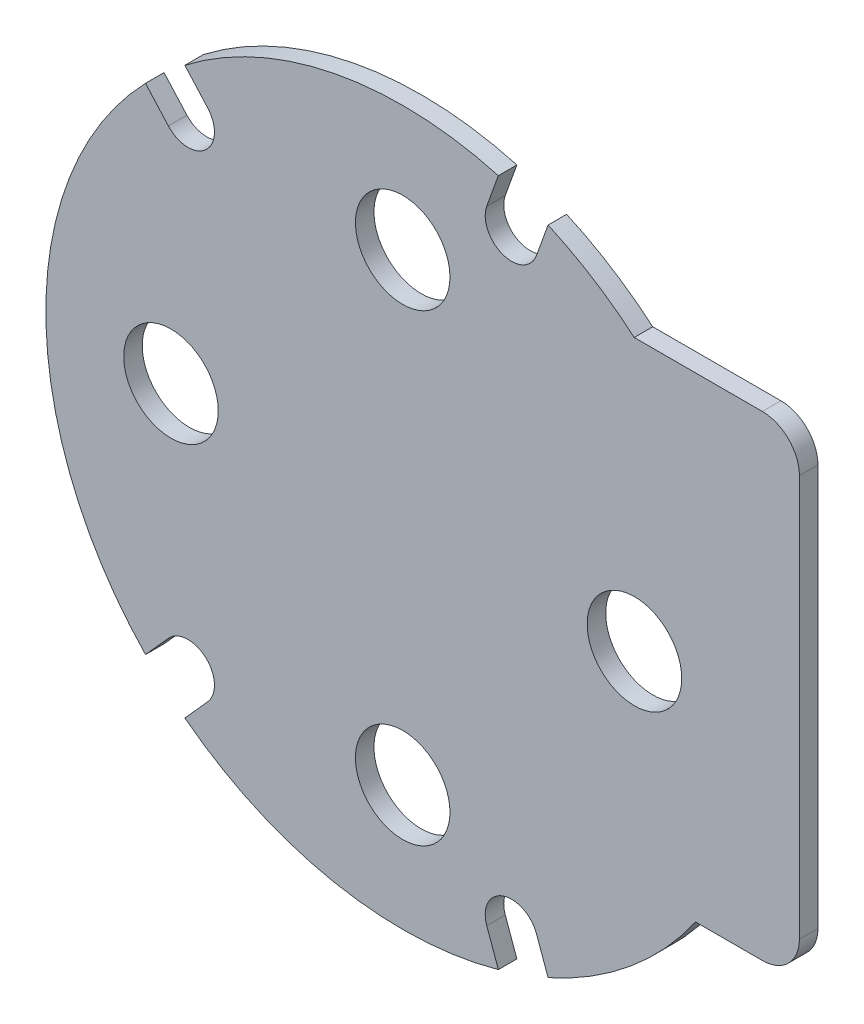
ISO-10303-21;
HEADER;
FILE_DESCRIPTION(('STEP AP214'),'2;1');
FILE_NAME('part.step','',(''),(''),'','','');
FILE_SCHEMA(('AUTOMOTIVE_DESIGN { 1 0 10303 214 1 1 1 1 }'));
ENDSEC;
DATA;
#1=APPLICATION_CONTEXT('core data for automotive mechanical design processes');
#2=APPLICATION_PROTOCOL_DEFINITION('international standard','automotive_design',2000,#1);
#3=PRODUCT_CONTEXT('',#1,'mechanical');
#4=PRODUCT('Part','Part','',(#3));
#5=PRODUCT_RELATED_PRODUCT_CATEGORY('part','',(#4));
#6=PRODUCT_DEFINITION_FORMATION('','',#4);
#7=PRODUCT_DEFINITION_CONTEXT('part definition',#1,'design');
#8=PRODUCT_DEFINITION('design','',#6,#7);
#9=PRODUCT_DEFINITION_SHAPE('','',#8);
#10=(LENGTH_UNIT() NAMED_UNIT(*) SI_UNIT(.MILLI.,.METRE.));
#11=(NAMED_UNIT(*) PLANE_ANGLE_UNIT() SI_UNIT($,.RADIAN.));
#12=(NAMED_UNIT(*) SI_UNIT($,.STERADIAN.) SOLID_ANGLE_UNIT());
#13=UNCERTAINTY_MEASURE_WITH_UNIT(LENGTH_MEASURE(1.E-05),#10,'distance_accuracy_value','');
#14=(GEOMETRIC_REPRESENTATION_CONTEXT(3) GLOBAL_UNCERTAINTY_ASSIGNED_CONTEXT((#13)) GLOBAL_UNIT_ASSIGNED_CONTEXT((#10,
#11,#12)) REPRESENTATION_CONTEXT('',''));
#15=CARTESIAN_POINT('',(0.,0.,0.));
#16=DIRECTION('',(0.,0.,1.));
#17=DIRECTION('',(1.,0.,0.));
#18=AXIS2_PLACEMENT_3D('',#15,#16,#17);
#19=CARTESIAN_POINT('',(0.,0.,2.));
#20=DIRECTION('',(0.,0.,1.));
#21=DIRECTION('',(1.,0.,0.));
#22=AXIS2_PLACEMENT_3D('',#19,#20,#21);
#23=PLANE('',#22);
#24=CARTESIAN_POINT('',(0.,25.,2.));
#25=DIRECTION('',(0.,0.,1.));
#26=DIRECTION('',(1.,0.,0.));
#27=AXIS2_PLACEMENT_3D('',#24,#25,#26);
#28=CIRCLE('',#27,5.1);
#29=CARTESIAN_POINT('',(5.09999999999999,25.,2.));
#30=VERTEX_POINT('',#29);
#31=EDGE_CURVE('E309',#30,#30,#28,.T.);
#32=ORIENTED_EDGE('',*,*,#31,.F.);
#33=EDGE_LOOP('',(#32));
#34=FACE_BOUND('',#33,.T.);
#35=CARTESIAN_POINT('',(0.,-25.,2.));
#36=DIRECTION('',(0.,0.,1.));
#37=DIRECTION('',(1.,0.,0.));
#38=AXIS2_PLACEMENT_3D('',#35,#36,#37);
#39=CIRCLE('',#38,5.1);
#40=CARTESIAN_POINT('',(5.10000000000001,-25.,2.));
#41=VERTEX_POINT('',#40);
#42=EDGE_CURVE('E321',#41,#41,#39,.T.);
#43=ORIENTED_EDGE('',*,*,#42,.F.);
#44=EDGE_LOOP('',(#43));
#45=FACE_BOUND('',#44,.T.);
#46=CARTESIAN_POINT('',(-25.,0.,2.));
#47=DIRECTION('',(0.,0.,1.));
#48=DIRECTION('',(1.,0.,0.));
#49=AXIS2_PLACEMENT_3D('',#46,#47,#48);
#50=CIRCLE('',#49,5.1);
#51=CARTESIAN_POINT('',(-19.9,0.,2.));
#52=VERTEX_POINT('',#51);
#53=EDGE_CURVE('E315',#52,#52,#50,.T.);
#54=ORIENTED_EDGE('',*,*,#53,.F.);
#55=EDGE_LOOP('',(#54));
#56=FACE_BOUND('',#55,.T.);
#57=CARTESIAN_POINT('',(25.,0.,2.));
#58=DIRECTION('',(0.,0.,1.));
#59=DIRECTION('',(1.,0.,0.));
#60=AXIS2_PLACEMENT_3D('',#57,#58,#59);
#61=CIRCLE('',#60,5.1);
#62=CARTESIAN_POINT('',(30.1,0.,2.));
#63=VERTEX_POINT('',#62);
#64=EDGE_CURVE('E303',#63,#63,#61,.T.);
#65=ORIENTED_EDGE('',*,*,#64,.F.);
#66=EDGE_LOOP('',(#65));
#67=FACE_BOUND('',#66,.T.);
#68=DIRECTION('',(0.,1.,0.));
#69=VECTOR('',#68,1.);
#70=CARTESIAN_POINT('',(42.8,29.3,2.));
#71=LINE('',#70,#69);
#72=CARTESIAN_POINT('',(42.8,-18.,2.));
#73=VERTEX_POINT('',#72);
#74=CARTESIAN_POINT('',(42.8,25.3,2.));
#75=VERTEX_POINT('',#74);
#76=EDGE_CURVE('E332',#73,#75,#71,.T.);
#77=ORIENTED_EDGE('',*,*,#76,.T.);
#78=CARTESIAN_POINT('',(38.8,25.3,2.));
#79=DIRECTION('',(0.,0.,1.));
#80=DIRECTION('',(1.,0.,0.));
#81=AXIS2_PLACEMENT_3D('',#78,#79,#80);
#82=CIRCLE('',#81,4.);
#83=CARTESIAN_POINT('',(38.8,29.3,2.));
#84=VERTEX_POINT('',#83);
#85=EDGE_CURVE('E40',#75,#84,#82,.T.);
#86=ORIENTED_EDGE('',*,*,#85,.T.);
#87=DIRECTION('',(-1.,0.,0.));
#88=VECTOR('',#87,1.);
#89=CARTESIAN_POINT('',(24.9751876869825,29.3,2.));
#90=LINE('',#89,#88);
#91=CARTESIAN_POINT('',(24.9751876869825,29.3,2.));
#92=VERTEX_POINT('',#91);
#93=EDGE_CURVE('E334',#84,#92,#90,.T.);
#94=ORIENTED_EDGE('',*,*,#93,.T.);
#95=CARTESIAN_POINT('',(0.,0.,2.));
#96=DIRECTION('',(0.,0.,1.));
#97=DIRECTION('',(1.,0.,0.));
#98=AXIS2_PLACEMENT_3D('',#95,#96,#97);
#99=CIRCLE('',#98,38.5);
#100=CARTESIAN_POINT('',(15.6828384392033,35.161037790285,2.));
#101=VERTEX_POINT('',#100);
#102=EDGE_CURVE('E207',#92,#101,#99,.T.);
#103=ORIENTED_EDGE('',*,*,#102,.T.);
#104=DIRECTION('',(0.338622846225681,0.940922190201729,0.));
#105=VECTOR('',#104,1.);
#106=CARTESIAN_POINT('',(14.4318410061061,31.6849248882568,2.));
#107=LINE('',#106,#105);
#108=CARTESIAN_POINT('',(14.4318410061061,31.6849248882568,2.));
#109=VERTEX_POINT('',#108);
#110=EDGE_CURVE('E194',#109,#101,#107,.T.);
#111=ORIENTED_EDGE('',*,*,#110,.F.);
#112=CARTESIAN_POINT('',(11.7502127640311,32.65,2.));
#113=DIRECTION('',(0.,0.,1.));
#114=DIRECTION('',(1.,0.,0.));
#115=AXIS2_PLACEMENT_3D('',#112,#113,#114);
#116=CIRCLE('',#115,2.85);
#117=CARTESIAN_POINT('',(9.06858452195621,33.6150751117432,2.));
#118=VERTEX_POINT('',#117);
#119=EDGE_CURVE('E184',#118,#109,#116,.T.);
#120=ORIENTED_EDGE('',*,*,#119,.F.);
#121=DIRECTION('',(-0.338622846225681,-0.940922190201729,0.));
#122=VECTOR('',#121,1.);
#123=CARTESIAN_POINT('',(9.06858452195621,33.6150751117432,2.));
#124=LINE('',#123,#122);
#125=CARTESIAN_POINT('',(10.3195819550534,37.0911880137714,2.));
#126=VERTEX_POINT('',#125);
#127=EDGE_CURVE('E208',#126,#118,#124,.T.);
#128=ORIENTED_EDGE('',*,*,#127,.F.);
#129=CARTESIAN_POINT('',(-23.5034170023146,30.493267932698,2.));
#130=VERTEX_POINT('',#129);
#131=EDGE_CURVE('E329',#126,#130,#99,.T.);
#132=ORIENTED_EDGE('',*,*,#131,.T.);
#133=DIRECTION('',(-0.667434411909216,0.744668587896253,0.));
#134=VECTOR('',#133,1.);
#135=CARTESIAN_POINT('',(-21.0376686177454,27.7421880739413,2.));
#136=LINE('',#135,#134);
#137=CARTESIAN_POINT('',(-21.0376686177454,27.7421880739413,2.));
#138=VERTEX_POINT('',#137);
#139=EDGE_CURVE('E224',#138,#130,#136,.T.);
#140=ORIENTED_EDGE('',*,*,#139,.F.);
#141=CARTESIAN_POINT('',(-23.1599740932498,25.84,2.));
#142=DIRECTION('',(0.,0.,1.));
#143=DIRECTION('',(1.,0.,0.));
#144=AXIS2_PLACEMENT_3D('',#141,#142,#143);
#145=CIRCLE('',#144,2.85);
#146=CARTESIAN_POINT('',(-25.2822795687541,23.9378119260587,2.));
#147=VERTEX_POINT('',#146);
#148=EDGE_CURVE('E222',#147,#138,#145,.T.);
#149=ORIENTED_EDGE('',*,*,#148,.F.);
#150=DIRECTION('',(0.667434411909216,-0.744668587896253,0.));
#151=VECTOR('',#150,1.);
#152=CARTESIAN_POINT('',(-25.2822795687541,23.9378119260587,2.));
#153=LINE('',#152,#151);
#154=CARTESIAN_POINT('',(-27.7480279533233,26.6888917848155,2.));
#155=VERTEX_POINT('',#154);
#156=EDGE_CURVE('E228',#155,#147,#153,.T.);
#157=ORIENTED_EDGE('',*,*,#156,.F.);
#158=CARTESIAN_POINT('',(-27.7480279533233,-26.6888917848155,2.));
#159=VERTEX_POINT('',#158);
#160=EDGE_CURVE('E411',#155,#159,#99,.T.);
#161=ORIENTED_EDGE('',*,*,#160,.T.);
#162=DIRECTION('',(-0.667434411909216,-0.744668587896253,0.));
#163=VECTOR('',#162,1.);
#164=CARTESIAN_POINT('',(-25.2822795687541,-23.9378119260587,2.));
#165=LINE('',#164,#163);
#166=CARTESIAN_POINT('',(-25.2822795687541,-23.9378119260587,2.));
#167=VERTEX_POINT('',#166);
#168=EDGE_CURVE('E251',#167,#159,#165,.T.);
#169=ORIENTED_EDGE('',*,*,#168,.F.);
#170=CARTESIAN_POINT('',(-23.1599740932498,-25.84,2.));
#171=DIRECTION('',(0.,0.,1.));
#172=DIRECTION('',(-1.,0.,0.));
#173=AXIS2_PLACEMENT_3D('',#170,#171,#172);
#174=CIRCLE('',#173,2.85);
#175=CARTESIAN_POINT('',(-21.0376686177454,-27.7421880739413,2.));
#176=VERTEX_POINT('',#175);
#177=EDGE_CURVE('E249',#176,#167,#174,.T.);
#178=ORIENTED_EDGE('',*,*,#177,.F.);
#179=DIRECTION('',(0.667434411909216,0.744668587896253,0.));
#180=VECTOR('',#179,1.);
#181=CARTESIAN_POINT('',(-21.0376686177454,-27.7421880739413,2.));
#182=LINE('',#181,#180);
#183=CARTESIAN_POINT('',(-23.5034170023146,-30.493267932698,2.));
#184=VERTEX_POINT('',#183);
#185=EDGE_CURVE('E255',#184,#176,#182,.T.);
#186=ORIENTED_EDGE('',*,*,#185,.F.);
#187=CARTESIAN_POINT('',(10.3195819550534,-37.0911880137714,2.));
#188=VERTEX_POINT('',#187);
#189=EDGE_CURVE('E412',#184,#188,#99,.T.);
#190=ORIENTED_EDGE('',*,*,#189,.T.);
#191=DIRECTION('',(0.338622846225681,-0.940922190201729,0.));
#192=VECTOR('',#191,1.);
#193=CARTESIAN_POINT('',(9.06858452195621,-33.6150751117432,2.));
#194=LINE('',#193,#192);
#195=CARTESIAN_POINT('',(9.06858452195621,-33.6150751117432,2.));
#196=VERTEX_POINT('',#195);
#197=EDGE_CURVE('E278',#196,#188,#194,.T.);
#198=ORIENTED_EDGE('',*,*,#197,.F.);
#199=CARTESIAN_POINT('',(11.7502127640311,-32.65,2.));
#200=DIRECTION('',(0.,0.,1.));
#201=DIRECTION('',(-1.,0.,0.));
#202=AXIS2_PLACEMENT_3D('',#199,#200,#201);
#203=CIRCLE('',#202,2.85);
#204=CARTESIAN_POINT('',(14.4318410061061,-31.6849248882568,2.));
#205=VERTEX_POINT('',#204);
#206=EDGE_CURVE('E276',#205,#196,#203,.T.);
#207=ORIENTED_EDGE('',*,*,#206,.F.);
#208=DIRECTION('',(-0.338622846225681,0.940922190201729,0.));
#209=VECTOR('',#208,1.);
#210=CARTESIAN_POINT('',(14.4318410061061,-31.6849248882568,2.));
#211=LINE('',#210,#209);
#212=CARTESIAN_POINT('',(15.6828384392033,-35.161037790285,2.));
#213=VERTEX_POINT('',#212);
#214=EDGE_CURVE('E282',#213,#205,#211,.T.);
#215=ORIENTED_EDGE('',*,*,#214,.F.);
#216=CARTESIAN_POINT('',(31.5950945559592,-22.,2.));
#217=VERTEX_POINT('',#216);
#218=EDGE_CURVE('E330',#213,#217,#99,.T.);
#219=ORIENTED_EDGE('',*,*,#218,.T.);
#220=DIRECTION('',(1.,0.,0.));
#221=VECTOR('',#220,1.);
#222=CARTESIAN_POINT('',(42.8,-22.,2.));
#223=LINE('',#222,#221);
#224=CARTESIAN_POINT('',(38.8,-22.,2.));
#225=VERTEX_POINT('',#224);
#226=EDGE_CURVE('E328',#217,#225,#223,.T.);
#227=ORIENTED_EDGE('',*,*,#226,.T.);
#228=CARTESIAN_POINT('',(38.8,-18.,2.));
#229=DIRECTION('',(0.,0.,1.));
#230=DIRECTION('',(1.,0.,0.));
#231=AXIS2_PLACEMENT_3D('',#228,#229,#230);
#232=CIRCLE('',#231,4.);
#233=EDGE_CURVE('E363',#225,#73,#232,.T.);
#234=ORIENTED_EDGE('',*,*,#233,.T.);
#235=EDGE_LOOP('',(#77,#86,#94,#103,#111,#120,#128,#132,#140,#149,#157,#161,#169,#178,#186,#190,
#198,#207,#215,#219,#227,#234));
#236=FACE_BOUND('',#235,.T.);
#237=ADVANCED_FACE('F32',(#34,#45,#56,#67,#236),#23,.T.);
#238=CARTESIAN_POINT('',(0.,0.,0.));
#239=DIRECTION('',(0.,0.,1.));
#240=DIRECTION('',(1.,0.,0.));
#241=AXIS2_PLACEMENT_3D('',#238,#239,#240);
#242=PLANE('',#241);
#243=CARTESIAN_POINT('',(0.,25.,0.));
#244=DIRECTION('',(0.,0.,1.));
#245=DIRECTION('',(1.,0.,0.));
#246=AXIS2_PLACEMENT_3D('',#243,#244,#245);
#247=CIRCLE('',#246,5.1);
#248=CARTESIAN_POINT('',(5.09999999999999,25.,0.));
#249=VERTEX_POINT('',#248);
#250=EDGE_CURVE('E306',#249,#249,#247,.T.);
#251=ORIENTED_EDGE('',*,*,#250,.T.);
#252=EDGE_LOOP('',(#251));
#253=FACE_BOUND('',#252,.T.);
#254=CARTESIAN_POINT('',(0.,-25.,0.));
#255=DIRECTION('',(0.,0.,1.));
#256=DIRECTION('',(1.,0.,0.));
#257=AXIS2_PLACEMENT_3D('',#254,#255,#256);
#258=CIRCLE('',#257,5.1);
#259=CARTESIAN_POINT('',(5.10000000000001,-25.,0.));
#260=VERTEX_POINT('',#259);
#261=EDGE_CURVE('E318',#260,#260,#258,.T.);
#262=ORIENTED_EDGE('',*,*,#261,.T.);
#263=EDGE_LOOP('',(#262));
#264=FACE_BOUND('',#263,.T.);
#265=CARTESIAN_POINT('',(-25.,0.,0.));
#266=DIRECTION('',(0.,0.,1.));
#267=DIRECTION('',(1.,0.,0.));
#268=AXIS2_PLACEMENT_3D('',#265,#266,#267);
#269=CIRCLE('',#268,5.1);
#270=CARTESIAN_POINT('',(-19.9,0.,0.));
#271=VERTEX_POINT('',#270);
#272=EDGE_CURVE('E312',#271,#271,#269,.T.);
#273=ORIENTED_EDGE('',*,*,#272,.T.);
#274=EDGE_LOOP('',(#273));
#275=FACE_BOUND('',#274,.T.);
#276=CARTESIAN_POINT('',(25.,0.,0.));
#277=DIRECTION('',(0.,0.,1.));
#278=DIRECTION('',(1.,0.,0.));
#279=AXIS2_PLACEMENT_3D('',#276,#277,#278);
#280=CIRCLE('',#279,5.1);
#281=CARTESIAN_POINT('',(30.1,0.,0.));
#282=VERTEX_POINT('',#281);
#283=EDGE_CURVE('E302',#282,#282,#280,.T.);
#284=ORIENTED_EDGE('',*,*,#283,.T.);
#285=EDGE_LOOP('',(#284));
#286=FACE_BOUND('',#285,.T.);
#287=DIRECTION('',(-1.,0.,0.));
#288=VECTOR('',#287,1.);
#289=CARTESIAN_POINT('',(24.9751876869825,29.3,0.));
#290=LINE('',#289,#288);
#291=CARTESIAN_POINT('',(38.8,29.3,0.));
#292=VERTEX_POINT('',#291);
#293=CARTESIAN_POINT('',(24.9751876869825,29.3,0.));
#294=VERTEX_POINT('',#293);
#295=EDGE_CURVE('E345',#292,#294,#290,.T.);
#296=ORIENTED_EDGE('',*,*,#295,.F.);
#297=CARTESIAN_POINT('',(38.8,25.3,0.));
#298=DIRECTION('',(0.,0.,1.));
#299=DIRECTION('',(1.,0.,0.));
#300=AXIS2_PLACEMENT_3D('',#297,#298,#299);
#301=CIRCLE('',#300,4.);
#302=CARTESIAN_POINT('',(42.8,25.3,0.));
#303=VERTEX_POINT('',#302);
#304=EDGE_CURVE('E357',#292,#303,#301,.F.);
#305=ORIENTED_EDGE('',*,*,#304,.T.);
#306=DIRECTION('',(0.,1.,0.));
#307=VECTOR('',#306,1.);
#308=CARTESIAN_POINT('',(42.8,29.3,0.));
#309=LINE('',#308,#307);
#310=CARTESIAN_POINT('',(42.8,-18.,0.));
#311=VERTEX_POINT('',#310);
#312=EDGE_CURVE('E343',#311,#303,#309,.T.);
#313=ORIENTED_EDGE('',*,*,#312,.F.);
#314=CARTESIAN_POINT('',(38.8,-18.,0.));
#315=DIRECTION('',(0.,0.,1.));
#316=DIRECTION('',(1.,0.,0.));
#317=AXIS2_PLACEMENT_3D('',#314,#315,#316);
#318=CIRCLE('',#317,4.);
#319=CARTESIAN_POINT('',(38.8,-22.,0.));
#320=VERTEX_POINT('',#319);
#321=EDGE_CURVE('E355',#311,#320,#318,.F.);
#322=ORIENTED_EDGE('',*,*,#321,.T.);
#323=DIRECTION('',(1.,0.,0.));
#324=VECTOR('',#323,1.);
#325=CARTESIAN_POINT('',(42.8,-22.,0.));
#326=LINE('',#325,#324);
#327=CARTESIAN_POINT('',(31.5950945559592,-22.,0.));
#328=VERTEX_POINT('',#327);
#329=EDGE_CURVE('E340',#328,#320,#326,.T.);
#330=ORIENTED_EDGE('',*,*,#329,.F.);
#331=CARTESIAN_POINT('',(0.,0.,0.));
#332=DIRECTION('',(0.,0.,1.));
#333=DIRECTION('',(1.,0.,0.));
#334=AXIS2_PLACEMENT_3D('',#331,#332,#333);
#335=CIRCLE('',#334,38.5);
#336=CARTESIAN_POINT('',(15.6828384392033,-35.161037790285,0.));
#337=VERTEX_POINT('',#336);
#338=EDGE_CURVE('E324',#337,#328,#335,.T.);
#339=ORIENTED_EDGE('',*,*,#338,.F.);
#340=DIRECTION('',(-0.338622846225681,0.940922190201729,0.));
#341=VECTOR('',#340,1.);
#342=CARTESIAN_POINT('',(14.4318410061061,-31.6849248882568,0.));
#343=LINE('',#342,#341);
#344=CARTESIAN_POINT('',(14.4318410061061,-31.6849248882568,0.));
#345=VERTEX_POINT('',#344);
#346=EDGE_CURVE('E279',#337,#345,#343,.T.);
#347=ORIENTED_EDGE('',*,*,#346,.T.);
#348=CARTESIAN_POINT('',(11.7502127640311,-32.65,0.));
#349=DIRECTION('',(0.,0.,1.));
#350=DIRECTION('',(-1.,0.,0.));
#351=AXIS2_PLACEMENT_3D('',#348,#349,#350);
#352=CIRCLE('',#351,2.85);
#353=CARTESIAN_POINT('',(9.06858452195621,-33.6150751117432,0.));
#354=VERTEX_POINT('',#353);
#355=EDGE_CURVE('E275',#345,#354,#352,.T.);
#356=ORIENTED_EDGE('',*,*,#355,.T.);
#357=DIRECTION('',(0.338622846225681,-0.940922190201729,0.));
#358=VECTOR('',#357,1.);
#359=CARTESIAN_POINT('',(9.06858452195621,-33.6150751117432,0.));
#360=LINE('',#359,#358);
#361=CARTESIAN_POINT('',(10.3195819550534,-37.0911880137714,0.));
#362=VERTEX_POINT('',#361);
#363=EDGE_CURVE('E287',#354,#362,#360,.T.);
#364=ORIENTED_EDGE('',*,*,#363,.T.);
#365=CARTESIAN_POINT('',(-23.5034170023146,-30.493267932698,0.));
#366=VERTEX_POINT('',#365);
#367=EDGE_CURVE('E388',#366,#362,#335,.T.);
#368=ORIENTED_EDGE('',*,*,#367,.F.);
#369=DIRECTION('',(0.667434411909216,0.744668587896253,0.));
#370=VECTOR('',#369,1.);
#371=CARTESIAN_POINT('',(-21.0376686177454,-27.7421880739413,0.));
#372=LINE('',#371,#370);
#373=CARTESIAN_POINT('',(-21.0376686177454,-27.7421880739413,0.));
#374=VERTEX_POINT('',#373);
#375=EDGE_CURVE('E252',#366,#374,#372,.T.);
#376=ORIENTED_EDGE('',*,*,#375,.T.);
#377=CARTESIAN_POINT('',(-23.1599740932498,-25.84,0.));
#378=DIRECTION('',(0.,0.,1.));
#379=DIRECTION('',(-1.,0.,0.));
#380=AXIS2_PLACEMENT_3D('',#377,#378,#379);
#381=CIRCLE('',#380,2.85);
#382=CARTESIAN_POINT('',(-25.2822795687541,-23.9378119260587,0.));
#383=VERTEX_POINT('',#382);
#384=EDGE_CURVE('E248',#374,#383,#381,.T.);
#385=ORIENTED_EDGE('',*,*,#384,.T.);
#386=DIRECTION('',(-0.667434411909216,-0.744668587896253,0.));
#387=VECTOR('',#386,1.);
#388=CARTESIAN_POINT('',(-25.2822795687541,-23.9378119260587,0.));
#389=LINE('',#388,#387);
#390=CARTESIAN_POINT('',(-27.7480279533233,-26.6888917848155,0.));
#391=VERTEX_POINT('',#390);
#392=EDGE_CURVE('E260',#383,#391,#389,.T.);
#393=ORIENTED_EDGE('',*,*,#392,.T.);
#394=CARTESIAN_POINT('',(-27.7480279533233,26.6888917848155,0.));
#395=VERTEX_POINT('',#394);
#396=EDGE_CURVE('E389',#395,#391,#335,.T.);
#397=ORIENTED_EDGE('',*,*,#396,.F.);
#398=DIRECTION('',(0.667434411909216,-0.744668587896253,0.));
#399=VECTOR('',#398,1.);
#400=CARTESIAN_POINT('',(-25.2822795687541,23.9378119260587,0.));
#401=LINE('',#400,#399);
#402=CARTESIAN_POINT('',(-25.2822795687541,23.9378119260587,0.));
#403=VERTEX_POINT('',#402);
#404=EDGE_CURVE('E225',#395,#403,#401,.T.);
#405=ORIENTED_EDGE('',*,*,#404,.T.);
#406=CARTESIAN_POINT('',(-23.1599740932498,25.84,0.));
#407=DIRECTION('',(0.,0.,1.));
#408=DIRECTION('',(1.,0.,0.));
#409=AXIS2_PLACEMENT_3D('',#406,#407,#408);
#410=CIRCLE('',#409,2.85);
#411=CARTESIAN_POINT('',(-21.0376686177454,27.7421880739413,0.));
#412=VERTEX_POINT('',#411);
#413=EDGE_CURVE('E202',#403,#412,#410,.T.);
#414=ORIENTED_EDGE('',*,*,#413,.T.);
#415=DIRECTION('',(-0.667434411909216,0.744668587896253,0.));
#416=VECTOR('',#415,1.);
#417=CARTESIAN_POINT('',(-21.0376686177454,27.7421880739413,0.));
#418=LINE('',#417,#416);
#419=CARTESIAN_POINT('',(-23.5034170023146,30.493267932698,0.));
#420=VERTEX_POINT('',#419);
#421=EDGE_CURVE('E233',#412,#420,#418,.T.);
#422=ORIENTED_EDGE('',*,*,#421,.T.);
#423=CARTESIAN_POINT('',(10.3195819550534,37.0911880137714,0.));
#424=VERTEX_POINT('',#423);
#425=EDGE_CURVE('E341',#424,#420,#335,.T.);
#426=ORIENTED_EDGE('',*,*,#425,.F.);
#427=DIRECTION('',(-0.338622846225681,-0.940922190201729,0.));
#428=VECTOR('',#427,1.);
#429=CARTESIAN_POINT('',(9.06858452195621,33.6150751117432,0.));
#430=LINE('',#429,#428);
#431=CARTESIAN_POINT('',(9.06858452195621,33.6150751117432,0.));
#432=VERTEX_POINT('',#431);
#433=EDGE_CURVE('E195',#424,#432,#430,.T.);
#434=ORIENTED_EDGE('',*,*,#433,.T.);
#435=CARTESIAN_POINT('',(11.7502127640311,32.65,0.));
#436=DIRECTION('',(0.,0.,1.));
#437=DIRECTION('',(1.,0.,0.));
#438=AXIS2_PLACEMENT_3D('',#435,#436,#437);
#439=CIRCLE('',#438,2.85);
#440=CARTESIAN_POINT('',(14.4318410061061,31.6849248882568,0.));
#441=VERTEX_POINT('',#440);
#442=EDGE_CURVE('E212',#432,#441,#439,.T.);
#443=ORIENTED_EDGE('',*,*,#442,.T.);
#444=DIRECTION('',(0.338622846225681,0.940922190201729,0.));
#445=VECTOR('',#444,1.);
#446=CARTESIAN_POINT('',(14.4318410061061,31.6849248882568,0.));
#447=LINE('',#446,#445);
#448=CARTESIAN_POINT('',(15.6828384392033,35.161037790285,0.));
#449=VERTEX_POINT('',#448);
#450=EDGE_CURVE('E201',#441,#449,#447,.T.);
#451=ORIENTED_EDGE('',*,*,#450,.T.);
#452=EDGE_CURVE('E337',#294,#449,#335,.T.);
#453=ORIENTED_EDGE('',*,*,#452,.F.);
#454=EDGE_LOOP('',(#296,#305,#313,#322,#330,#339,#347,#356,#364,#368,#376,#385,#393,#397,#405,
#414,#422,#426,#434,#443,#451,#453));
#455=FACE_BOUND('',#454,.T.);
#456=ADVANCED_FACE('F375',(#253,#264,#275,#286,#455),#242,.F.);
#457=CARTESIAN_POINT('',(0.,0.,2.));
#458=DIRECTION('',(0.,0.,-1.));
#459=DIRECTION('',(-1.,0.,0.));
#460=AXIS2_PLACEMENT_3D('',#457,#458,#459);
#461=CYLINDRICAL_SURFACE('',#460,38.5);
#462=DIRECTION('',(0.,0.,-1.));
#463=VECTOR('',#462,1.);
#464=CARTESIAN_POINT('',(15.6828384392033,35.161037790285,2.));
#465=LINE('',#464,#463);
#466=EDGE_CURVE('E203',#101,#449,#465,.T.);
#467=ORIENTED_EDGE('',*,*,#466,.F.);
#468=ORIENTED_EDGE('',*,*,#102,.F.);
#469=DIRECTION('',(0.,0.,-1.));
#470=VECTOR('',#469,1.);
#471=CARTESIAN_POINT('',(24.9751876869825,29.3,2.));
#472=LINE('',#471,#470);
#473=EDGE_CURVE('E336',#92,#294,#472,.T.);
#474=ORIENTED_EDGE('',*,*,#473,.T.);
#475=ORIENTED_EDGE('',*,*,#452,.T.);
#476=EDGE_LOOP('',(#467,#468,#474,#475));
#477=FACE_BOUND('',#476,.T.);
#478=ADVANCED_FACE('F457',(#477),#461,.T.);
#479=DIRECTION('',(0.,0.,-1.));
#480=VECTOR('',#479,1.);
#481=CARTESIAN_POINT('',(10.3195819550534,37.0911880137714,2.));
#482=LINE('',#481,#480);
#483=EDGE_CURVE('E218',#126,#424,#482,.T.);
#484=ORIENTED_EDGE('',*,*,#483,.T.);
#485=ORIENTED_EDGE('',*,*,#425,.T.);
#486=DIRECTION('',(0.,0.,-1.));
#487=VECTOR('',#486,1.);
#488=CARTESIAN_POINT('',(-23.5034170023146,30.493267932698,2.));
#489=LINE('',#488,#487);
#490=EDGE_CURVE('E242',#130,#420,#489,.T.);
#491=ORIENTED_EDGE('',*,*,#490,.F.);
#492=ORIENTED_EDGE('',*,*,#131,.F.);
#493=EDGE_LOOP('',(#484,#485,#491,#492));
#494=FACE_BOUND('',#493,.T.);
#495=ADVANCED_FACE('F399',(#494),#461,.T.);
#496=DIRECTION('',(0.,0.,-1.));
#497=VECTOR('',#496,1.);
#498=CARTESIAN_POINT('',(-27.7480279533233,26.6888917848155,2.));
#499=LINE('',#498,#497);
#500=EDGE_CURVE('E239',#155,#395,#499,.T.);
#501=ORIENTED_EDGE('',*,*,#500,.T.);
#502=ORIENTED_EDGE('',*,*,#396,.T.);
#503=DIRECTION('',(0.,0.,-1.));
#504=VECTOR('',#503,1.);
#505=CARTESIAN_POINT('',(-27.7480279533233,-26.6888917848155,2.));
#506=LINE('',#505,#504);
#507=EDGE_CURVE('E269',#159,#391,#506,.T.);
#508=ORIENTED_EDGE('',*,*,#507,.F.);
#509=ORIENTED_EDGE('',*,*,#160,.F.);
#510=EDGE_LOOP('',(#501,#502,#508,#509));
#511=FACE_BOUND('',#510,.T.);
#512=ADVANCED_FACE('F440',(#511),#461,.T.);
#513=DIRECTION('',(0.,0.,-1.));
#514=VECTOR('',#513,1.);
#515=CARTESIAN_POINT('',(-23.5034170023146,-30.493267932698,2.));
#516=LINE('',#515,#514);
#517=EDGE_CURVE('E266',#184,#366,#516,.T.);
#518=ORIENTED_EDGE('',*,*,#517,.T.);
#519=ORIENTED_EDGE('',*,*,#367,.T.);
#520=DIRECTION('',(0.,0.,-1.));
#521=VECTOR('',#520,1.);
#522=CARTESIAN_POINT('',(10.3195819550534,-37.0911880137714,2.));
#523=LINE('',#522,#521);
#524=EDGE_CURVE('E296',#188,#362,#523,.T.);
#525=ORIENTED_EDGE('',*,*,#524,.F.);
#526=ORIENTED_EDGE('',*,*,#189,.F.);
#527=EDGE_LOOP('',(#518,#519,#525,#526));
#528=FACE_BOUND('',#527,.T.);
#529=ADVANCED_FACE('F429',(#528),#461,.T.);
#530=DIRECTION('',(0.,0.,-1.));
#531=VECTOR('',#530,1.);
#532=CARTESIAN_POINT('',(15.6828384392033,-35.161037790285,2.));
#533=LINE('',#532,#531);
#534=EDGE_CURVE('E293',#213,#337,#533,.T.);
#535=ORIENTED_EDGE('',*,*,#534,.T.);
#536=ORIENTED_EDGE('',*,*,#338,.T.);
#537=DIRECTION('',(0.,0.,-1.));
#538=VECTOR('',#537,1.);
#539=CARTESIAN_POINT('',(31.5950945559592,-22.,2.));
#540=LINE('',#539,#538);
#541=EDGE_CURVE('E349',#217,#328,#540,.T.);
#542=ORIENTED_EDGE('',*,*,#541,.F.);
#543=ORIENTED_EDGE('',*,*,#218,.F.);
#544=EDGE_LOOP('',(#535,#536,#542,#543));
#545=FACE_BOUND('',#544,.T.);
#546=ADVANCED_FACE('F387',(#545),#461,.T.);
#547=CARTESIAN_POINT('',(42.8,-22.,2.));
#548=DIRECTION('',(0.,1.,0.));
#549=DIRECTION('',(-1.,0.,0.));
#550=AXIS2_PLACEMENT_3D('',#547,#548,#549);
#551=PLANE('',#550);
#552=ORIENTED_EDGE('',*,*,#329,.T.);
#553=DIRECTION('',(0.,0.,-1.));
#554=VECTOR('',#553,1.);
#555=CARTESIAN_POINT('',(38.8,-22.,2.));
#556=LINE('',#555,#554);
#557=EDGE_CURVE('E11',#320,#225,#556,.F.);
#558=ORIENTED_EDGE('',*,*,#557,.T.);
#559=ORIENTED_EDGE('',*,*,#226,.F.);
#560=ORIENTED_EDGE('',*,*,#541,.T.);
#561=EDGE_LOOP('',(#552,#558,#559,#560));
#562=FACE_BOUND('',#561,.T.);
#563=ADVANCED_FACE('F383',(#562),#551,.F.);
#564=CARTESIAN_POINT('',(42.8,29.3,2.));
#565=DIRECTION('',(-1.,0.,0.));
#566=DIRECTION('',(0.,-1.,0.));
#567=AXIS2_PLACEMENT_3D('',#564,#565,#566);
#568=PLANE('',#567);
#569=ORIENTED_EDGE('',*,*,#312,.T.);
#570=DIRECTION('',(0.,0.,-1.));
#571=VECTOR('',#570,1.);
#572=CARTESIAN_POINT('',(42.8,25.3,2.));
#573=LINE('',#572,#571);
#574=EDGE_CURVE('E53',#303,#75,#573,.F.);
#575=ORIENTED_EDGE('',*,*,#574,.T.);
#576=ORIENTED_EDGE('',*,*,#76,.F.);
#577=DIRECTION('',(0.,0.,-1.));
#578=VECTOR('',#577,1.);
#579=CARTESIAN_POINT('',(42.8,-18.,2.));
#580=LINE('',#579,#578);
#581=EDGE_CURVE('E359',#73,#311,#580,.T.);
#582=ORIENTED_EDGE('',*,*,#581,.T.);
#583=EDGE_LOOP('',(#569,#575,#576,#582));
#584=FACE_BOUND('',#583,.T.);
#585=ADVANCED_FACE('F377',(#584),#568,.F.);
#586=CARTESIAN_POINT('',(24.9751876869825,29.3,2.));
#587=DIRECTION('',(0.,-1.,0.));
#588=DIRECTION('',(0.,0.,-1.));
#589=AXIS2_PLACEMENT_3D('',#586,#587,#588);
#590=PLANE('',#589);
#591=ORIENTED_EDGE('',*,*,#93,.F.);
#592=DIRECTION('',(0.,0.,-1.));
#593=VECTOR('',#592,1.);
#594=CARTESIAN_POINT('',(38.8,29.3,2.));
#595=LINE('',#594,#593);
#596=EDGE_CURVE('E352',#84,#292,#595,.T.);
#597=ORIENTED_EDGE('',*,*,#596,.T.);
#598=ORIENTED_EDGE('',*,*,#295,.T.);
#599=ORIENTED_EDGE('',*,*,#473,.F.);
#600=EDGE_LOOP('',(#591,#597,#598,#599));
#601=FACE_BOUND('',#600,.T.);
#602=ADVANCED_FACE('F370',(#601),#590,.F.);
#603=CARTESIAN_POINT('',(0.,-25.,2.));
#604=DIRECTION('',(0.,0.,-1.));
#605=DIRECTION('',(-1.,0.,0.));
#606=AXIS2_PLACEMENT_3D('',#603,#604,#605);
#607=CYLINDRICAL_SURFACE('',#606,5.1);
#608=ORIENTED_EDGE('',*,*,#42,.T.);
#609=EDGE_LOOP('',(#608));
#610=FACE_BOUND('',#609,.T.);
#611=ORIENTED_EDGE('',*,*,#261,.F.);
#612=EDGE_LOOP('',(#611));
#613=FACE_BOUND('',#612,.T.);
#614=ADVANCED_FACE('F463',(#610,#613),#607,.F.);
#615=CARTESIAN_POINT('',(-25.,0.,2.));
#616=DIRECTION('',(0.,0.,-1.));
#617=DIRECTION('',(-1.,0.,0.));
#618=AXIS2_PLACEMENT_3D('',#615,#616,#617);
#619=CYLINDRICAL_SURFACE('',#618,5.1);
#620=ORIENTED_EDGE('',*,*,#53,.T.);
#621=EDGE_LOOP('',(#620));
#622=FACE_BOUND('',#621,.T.);
#623=ORIENTED_EDGE('',*,*,#272,.F.);
#624=EDGE_LOOP('',(#623));
#625=FACE_BOUND('',#624,.T.);
#626=ADVANCED_FACE('F614',(#622,#625),#619,.F.);
#627=CARTESIAN_POINT('',(0.,25.,2.));
#628=DIRECTION('',(0.,0.,-1.));
#629=DIRECTION('',(-1.,0.,0.));
#630=AXIS2_PLACEMENT_3D('',#627,#628,#629);
#631=CYLINDRICAL_SURFACE('',#630,5.1);
#632=ORIENTED_EDGE('',*,*,#31,.T.);
#633=EDGE_LOOP('',(#632));
#634=FACE_BOUND('',#633,.T.);
#635=ORIENTED_EDGE('',*,*,#250,.F.);
#636=EDGE_LOOP('',(#635));
#637=FACE_BOUND('',#636,.T.);
#638=ADVANCED_FACE('F604',(#634,#637),#631,.F.);
#639=CARTESIAN_POINT('',(25.,0.,2.));
#640=DIRECTION('',(0.,0.,-1.));
#641=DIRECTION('',(-1.,0.,0.));
#642=AXIS2_PLACEMENT_3D('',#639,#640,#641);
#643=CYLINDRICAL_SURFACE('',#642,5.1);
#644=ORIENTED_EDGE('',*,*,#64,.T.);
#645=EDGE_LOOP('',(#644));
#646=FACE_BOUND('',#645,.T.);
#647=ORIENTED_EDGE('',*,*,#283,.F.);
#648=EDGE_LOOP('',(#647));
#649=FACE_BOUND('',#648,.T.);
#650=ADVANCED_FACE('F559',(#646,#649),#643,.F.);
#651=CARTESIAN_POINT('',(11.7502127640311,-32.65,2.));
#652=DIRECTION('',(0.,0.,-1.));
#653=DIRECTION('',(-1.,0.,0.));
#654=AXIS2_PLACEMENT_3D('',#651,#652,#653);
#655=CYLINDRICAL_SURFACE('',#654,2.85);
#656=ORIENTED_EDGE('',*,*,#355,.F.);
#657=DIRECTION('',(0.,0.,-1.));
#658=VECTOR('',#657,1.);
#659=CARTESIAN_POINT('',(14.4318410061061,-31.6849248882568,2.));
#660=LINE('',#659,#658);
#661=EDGE_CURVE('E284',#205,#345,#660,.T.);
#662=ORIENTED_EDGE('',*,*,#661,.F.);
#663=ORIENTED_EDGE('',*,*,#206,.T.);
#664=DIRECTION('',(0.,0.,-1.));
#665=VECTOR('',#664,1.);
#666=CARTESIAN_POINT('',(9.06858452195621,-33.6150751117432,2.));
#667=LINE('',#666,#665);
#668=EDGE_CURVE('E299',#196,#354,#667,.T.);
#669=ORIENTED_EDGE('',*,*,#668,.T.);
#670=EDGE_LOOP('',(#656,#662,#663,#669));
#671=FACE_BOUND('',#670,.T.);
#672=ADVANCED_FACE('F425',(#671),#655,.F.);
#673=CARTESIAN_POINT('',(9.06858452195621,-33.6150751117432,2.));
#674=DIRECTION('',(0.940922190201729,0.338622846225681,0.));
#675=DIRECTION('',(-0.338622846225681,0.940922190201729,0.));
#676=AXIS2_PLACEMENT_3D('',#673,#674,#675);
#677=PLANE('',#676);
#678=ORIENTED_EDGE('',*,*,#363,.F.);
#679=ORIENTED_EDGE('',*,*,#668,.F.);
#680=ORIENTED_EDGE('',*,*,#197,.T.);
#681=ORIENTED_EDGE('',*,*,#524,.T.);
#682=EDGE_LOOP('',(#678,#679,#680,#681));
#683=FACE_BOUND('',#682,.T.);
#684=ADVANCED_FACE('F428',(#683),#677,.T.);
#685=CARTESIAN_POINT('',(14.4318410061061,-31.6849248882568,2.));
#686=DIRECTION('',(-0.940922190201729,-0.338622846225681,0.));
#687=DIRECTION('',(0.338622846225681,-0.940922190201729,0.));
#688=AXIS2_PLACEMENT_3D('',#685,#686,#687);
#689=PLANE('',#688);
#690=ORIENTED_EDGE('',*,*,#346,.F.);
#691=ORIENTED_EDGE('',*,*,#534,.F.);
#692=ORIENTED_EDGE('',*,*,#214,.T.);
#693=ORIENTED_EDGE('',*,*,#661,.T.);
#694=EDGE_LOOP('',(#690,#691,#692,#693));
#695=FACE_BOUND('',#694,.T.);
#696=ADVANCED_FACE('F422',(#695),#689,.T.);
#697=CARTESIAN_POINT('',(-23.1599740932498,-25.84,2.));
#698=DIRECTION('',(0.,0.,-1.));
#699=DIRECTION('',(-1.,0.,0.));
#700=AXIS2_PLACEMENT_3D('',#697,#698,#699);
#701=CYLINDRICAL_SURFACE('',#700,2.85);
#702=ORIENTED_EDGE('',*,*,#384,.F.);
#703=DIRECTION('',(0.,0.,-1.));
#704=VECTOR('',#703,1.);
#705=CARTESIAN_POINT('',(-21.0376686177454,-27.7421880739413,2.));
#706=LINE('',#705,#704);
#707=EDGE_CURVE('E257',#176,#374,#706,.T.);
#708=ORIENTED_EDGE('',*,*,#707,.F.);
#709=ORIENTED_EDGE('',*,*,#177,.T.);
#710=DIRECTION('',(0.,0.,-1.));
#711=VECTOR('',#710,1.);
#712=CARTESIAN_POINT('',(-25.2822795687541,-23.9378119260587,2.));
#713=LINE('',#712,#711);
#714=EDGE_CURVE('E272',#167,#383,#713,.T.);
#715=ORIENTED_EDGE('',*,*,#714,.T.);
#716=EDGE_LOOP('',(#702,#708,#709,#715));
#717=FACE_BOUND('',#716,.T.);
#718=ADVANCED_FACE('F437',(#717),#701,.F.);
#719=CARTESIAN_POINT('',(-25.2822795687541,-23.9378119260587,2.));
#720=DIRECTION('',(0.744668587896253,-0.667434411909216,0.));
#721=DIRECTION('',(0.667434411909216,0.744668587896253,0.));
#722=AXIS2_PLACEMENT_3D('',#719,#720,#721);
#723=PLANE('',#722);
#724=ORIENTED_EDGE('',*,*,#392,.F.);
#725=ORIENTED_EDGE('',*,*,#714,.F.);
#726=ORIENTED_EDGE('',*,*,#168,.T.);
#727=ORIENTED_EDGE('',*,*,#507,.T.);
#728=EDGE_LOOP('',(#724,#725,#726,#727));
#729=FACE_BOUND('',#728,.T.);
#730=ADVANCED_FACE('F439',(#729),#723,.T.);
#731=CARTESIAN_POINT('',(-21.0376686177454,-27.7421880739413,2.));
#732=DIRECTION('',(-0.744668587896253,0.667434411909215,0.));
#733=DIRECTION('',(-0.667434411909216,-0.744668587896253,0.));
#734=AXIS2_PLACEMENT_3D('',#731,#732,#733);
#735=PLANE('',#734);
#736=ORIENTED_EDGE('',*,*,#375,.F.);
#737=ORIENTED_EDGE('',*,*,#517,.F.);
#738=ORIENTED_EDGE('',*,*,#185,.T.);
#739=ORIENTED_EDGE('',*,*,#707,.T.);
#740=EDGE_LOOP('',(#736,#737,#738,#739));
#741=FACE_BOUND('',#740,.T.);
#742=ADVANCED_FACE('F431',(#741),#735,.T.);
#743=CARTESIAN_POINT('',(-23.1599740932498,25.84,2.));
#744=DIRECTION('',(0.,0.,-1.));
#745=DIRECTION('',(-1.,0.,0.));
#746=AXIS2_PLACEMENT_3D('',#743,#744,#745);
#747=CYLINDRICAL_SURFACE('',#746,2.85);
#748=ORIENTED_EDGE('',*,*,#413,.F.);
#749=DIRECTION('',(0.,0.,-1.));
#750=VECTOR('',#749,1.);
#751=CARTESIAN_POINT('',(-25.2822795687541,23.9378119260587,2.));
#752=LINE('',#751,#750);
#753=EDGE_CURVE('E230',#147,#403,#752,.T.);
#754=ORIENTED_EDGE('',*,*,#753,.F.);
#755=ORIENTED_EDGE('',*,*,#148,.T.);
#756=DIRECTION('',(0.,0.,-1.));
#757=VECTOR('',#756,1.);
#758=CARTESIAN_POINT('',(-21.0376686177454,27.7421880739413,2.));
#759=LINE('',#758,#757);
#760=EDGE_CURVE('E245',#138,#412,#759,.T.);
#761=ORIENTED_EDGE('',*,*,#760,.T.);
#762=EDGE_LOOP('',(#748,#754,#755,#761));
#763=FACE_BOUND('',#762,.T.);
#764=ADVANCED_FACE('F408',(#763),#747,.F.);
#765=CARTESIAN_POINT('',(-21.0376686177454,27.7421880739413,2.));
#766=DIRECTION('',(-0.744668587896253,-0.667434411909215,0.));
#767=DIRECTION('',(0.667434411909216,-0.744668587896253,0.));
#768=AXIS2_PLACEMENT_3D('',#765,#766,#767);
#769=PLANE('',#768);
#770=ORIENTED_EDGE('',*,*,#421,.F.);
#771=ORIENTED_EDGE('',*,*,#760,.F.);
#772=ORIENTED_EDGE('',*,*,#139,.T.);
#773=ORIENTED_EDGE('',*,*,#490,.T.);
#774=EDGE_LOOP('',(#770,#771,#772,#773));
#775=FACE_BOUND('',#774,.T.);
#776=ADVANCED_FACE('F402',(#775),#769,.T.);
#777=CARTESIAN_POINT('',(-25.2822795687541,23.9378119260587,2.));
#778=DIRECTION('',(0.744668587896253,0.667434411909216,0.));
#779=DIRECTION('',(-0.667434411909216,0.744668587896253,0.));
#780=AXIS2_PLACEMENT_3D('',#777,#778,#779);
#781=PLANE('',#780);
#782=ORIENTED_EDGE('',*,*,#404,.F.);
#783=ORIENTED_EDGE('',*,*,#500,.F.);
#784=ORIENTED_EDGE('',*,*,#156,.T.);
#785=ORIENTED_EDGE('',*,*,#753,.T.);
#786=EDGE_LOOP('',(#782,#783,#784,#785));
#787=FACE_BOUND('',#786,.T.);
#788=ADVANCED_FACE('F442',(#787),#781,.T.);
#789=CARTESIAN_POINT('',(11.7502127640311,32.65,2.));
#790=DIRECTION('',(0.,0.,-1.));
#791=DIRECTION('',(-1.,0.,0.));
#792=AXIS2_PLACEMENT_3D('',#789,#790,#791);
#793=CYLINDRICAL_SURFACE('',#792,2.85);
#794=ORIENTED_EDGE('',*,*,#442,.F.);
#795=DIRECTION('',(0.,0.,-1.));
#796=VECTOR('',#795,1.);
#797=CARTESIAN_POINT('',(9.06858452195621,33.6150751117432,2.));
#798=LINE('',#797,#796);
#799=EDGE_CURVE('E190',#118,#432,#798,.T.);
#800=ORIENTED_EDGE('',*,*,#799,.F.);
#801=ORIENTED_EDGE('',*,*,#119,.T.);
#802=DIRECTION('',(0.,0.,-1.));
#803=VECTOR('',#802,1.);
#804=CARTESIAN_POINT('',(14.4318410061061,31.6849248882568,2.));
#805=LINE('',#804,#803);
#806=EDGE_CURVE('E188',#109,#441,#805,.T.);
#807=ORIENTED_EDGE('',*,*,#806,.T.);
#808=EDGE_LOOP('',(#794,#800,#801,#807));
#809=FACE_BOUND('',#808,.T.);
#810=ADVANCED_FACE('F187',(#809),#793,.F.);
#811=CARTESIAN_POINT('',(14.4318410061061,31.6849248882568,2.));
#812=DIRECTION('',(-0.940922190201729,0.338622846225681,0.));
#813=DIRECTION('',(-0.338622846225681,-0.940922190201729,0.));
#814=AXIS2_PLACEMENT_3D('',#811,#812,#813);
#815=PLANE('',#814);
#816=ORIENTED_EDGE('',*,*,#450,.F.);
#817=ORIENTED_EDGE('',*,*,#806,.F.);
#818=ORIENTED_EDGE('',*,*,#110,.T.);
#819=ORIENTED_EDGE('',*,*,#466,.T.);
#820=EDGE_LOOP('',(#816,#817,#818,#819));
#821=FACE_BOUND('',#820,.T.);
#822=ADVANCED_FACE('F198',(#821),#815,.T.);
#823=CARTESIAN_POINT('',(9.06858452195621,33.6150751117432,2.));
#824=DIRECTION('',(0.940922190201729,-0.338622846225681,0.));
#825=DIRECTION('',(0.338622846225681,0.940922190201729,0.));
#826=AXIS2_PLACEMENT_3D('',#823,#824,#825);
#827=PLANE('',#826);
#828=ORIENTED_EDGE('',*,*,#433,.F.);
#829=ORIENTED_EDGE('',*,*,#483,.F.);
#830=ORIENTED_EDGE('',*,*,#127,.T.);
#831=ORIENTED_EDGE('',*,*,#799,.T.);
#832=EDGE_LOOP('',(#828,#829,#830,#831));
#833=FACE_BOUND('',#832,.T.);
#834=ADVANCED_FACE('F475',(#833),#827,.T.);
#835=CARTESIAN_POINT('',(38.8,25.3,2.));
#836=DIRECTION('',(0.,0.,-1.));
#837=DIRECTION('',(-1.,0.,0.));
#838=AXIS2_PLACEMENT_3D('',#835,#836,#837);
#839=CYLINDRICAL_SURFACE('',#838,4.);
#840=ORIENTED_EDGE('',*,*,#85,.F.);
#841=ORIENTED_EDGE('',*,*,#574,.F.);
#842=ORIENTED_EDGE('',*,*,#304,.F.);
#843=ORIENTED_EDGE('',*,*,#596,.F.);
#844=EDGE_LOOP('',(#840,#841,#842,#843));
#845=FACE_BOUND('',#844,.T.);
#846=ADVANCED_FACE('F372',(#845),#839,.T.);
#847=CARTESIAN_POINT('',(38.8,-18.,2.));
#848=DIRECTION('',(0.,0.,-1.));
#849=DIRECTION('',(-1.,0.,0.));
#850=AXIS2_PLACEMENT_3D('',#847,#848,#849);
#851=CYLINDRICAL_SURFACE('',#850,4.);
#852=ORIENTED_EDGE('',*,*,#233,.F.);
#853=ORIENTED_EDGE('',*,*,#557,.F.);
#854=ORIENTED_EDGE('',*,*,#321,.F.);
#855=ORIENTED_EDGE('',*,*,#581,.F.);
#856=EDGE_LOOP('',(#852,#853,#854,#855));
#857=FACE_BOUND('',#856,.T.);
#858=ADVANCED_FACE('F34',(#857),#851,.T.);
#859=CLOSED_SHELL('',(#237,#456,#478,#495,#512,#529,#546,#563,#585,#602,#614,#626,#638,#650,
#672,#684,#696,#718,#730,#742,#764,#776,#788,#810,#822,#834,#846,#858));
#860=MANIFOLD_SOLID_BREP('B2',#859);
#861=ADVANCED_BREP_SHAPE_REPRESENTATION('',(#18,#860),#14);
#862=SHAPE_DEFINITION_REPRESENTATION(#9,#861);
ENDSEC;
END-ISO-10303-21;
